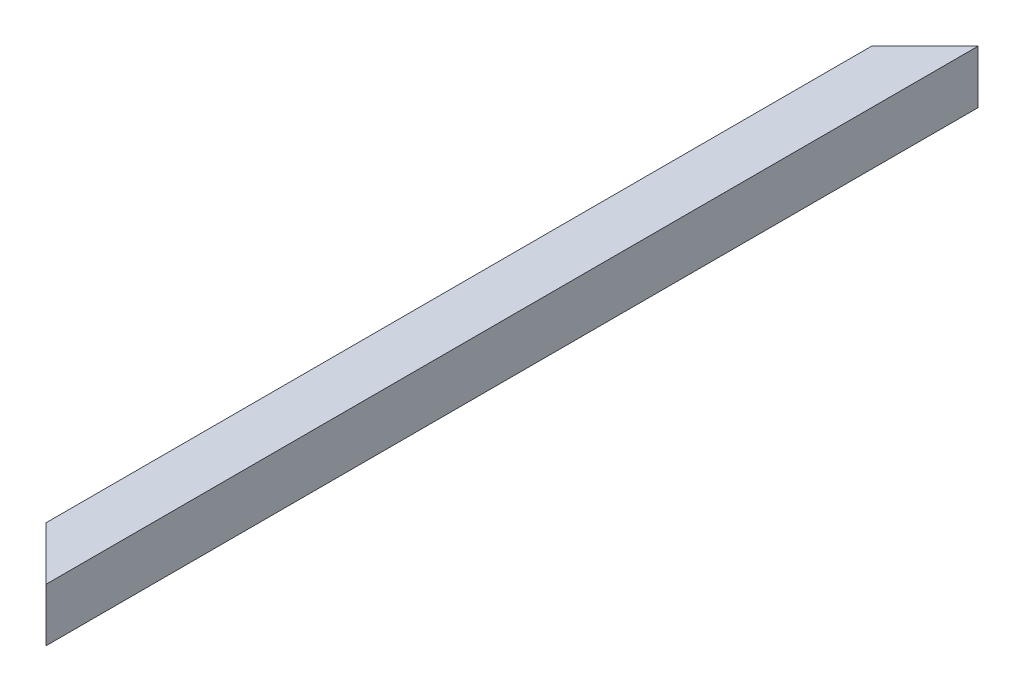
ISO-10303-21;
HEADER;
FILE_DESCRIPTION(('STEP AP214'),'2;1');
FILE_NAME('part.step','',(''),(''),'','','');
FILE_SCHEMA(('AUTOMOTIVE_DESIGN { 1 0 10303 214 1 1 1 1 }'));
ENDSEC;
DATA;
#1=APPLICATION_CONTEXT('core data for automotive mechanical design processes');
#2=APPLICATION_PROTOCOL_DEFINITION('international standard','automotive_design',2000,#1);
#3=PRODUCT_CONTEXT('',#1,'mechanical');
#4=PRODUCT('Part','Part','',(#3));
#5=PRODUCT_RELATED_PRODUCT_CATEGORY('part','',(#4));
#6=PRODUCT_DEFINITION_FORMATION('','',#4);
#7=PRODUCT_DEFINITION_CONTEXT('part definition',#1,'design');
#8=PRODUCT_DEFINITION('design','',#6,#7);
#9=PRODUCT_DEFINITION_SHAPE('','',#8);
#10=(LENGTH_UNIT() NAMED_UNIT(*) SI_UNIT(.MILLI.,.METRE.));
#11=(NAMED_UNIT(*) PLANE_ANGLE_UNIT() SI_UNIT($,.RADIAN.));
#12=(NAMED_UNIT(*) SI_UNIT($,.STERADIAN.) SOLID_ANGLE_UNIT());
#13=UNCERTAINTY_MEASURE_WITH_UNIT(LENGTH_MEASURE(1.E-05),#10,'distance_accuracy_value','');
#14=(GEOMETRIC_REPRESENTATION_CONTEXT(3) GLOBAL_UNCERTAINTY_ASSIGNED_CONTEXT((#13)) GLOBAL_UNIT_ASSIGNED_CONTEXT((#10,
#11,#12)) REPRESENTATION_CONTEXT('',''));
#15=CARTESIAN_POINT('',(0.,0.,0.));
#16=DIRECTION('',(0.,0.,1.));
#17=DIRECTION('',(1.,0.,0.));
#18=AXIS2_PLACEMENT_3D('',#15,#16,#17);
#19=CARTESIAN_POINT('',(-16.,16.,0.));
#20=DIRECTION('',(1.,0.,0.));
#21=DIRECTION('',(0.,0.,-1.));
#22=AXIS2_PLACEMENT_3D('',#19,#20,#21);
#23=PLANE('',#22);
#24=DIRECTION('',(0.,-1.,0.));
#25=VECTOR('',#24,1.);
#26=CARTESIAN_POINT('',(-16.,16.,35.9999999999996));
#27=LINE('',#26,#25);
#28=CARTESIAN_POINT('',(-16.,16.,35.9999999999996));
#29=VERTEX_POINT('',#28);
#30=CARTESIAN_POINT('',(-16.,-16.,35.9999999999996));
#31=VERTEX_POINT('',#30);
#32=EDGE_CURVE('E11',#29,#31,#27,.T.);
#33=ORIENTED_EDGE('',*,*,#32,.F.);
#34=DIRECTION('',(0.,0.,1.));
#35=VECTOR('',#34,1.);
#36=CARTESIAN_POINT('',(-16.,16.,0.));
#37=LINE('',#36,#35);
#38=CARTESIAN_POINT('',(-16.,16.,664.));
#39=VERTEX_POINT('',#38);
#40=EDGE_CURVE('E148',#29,#39,#37,.T.);
#41=ORIENTED_EDGE('',*,*,#40,.T.);
#42=DIRECTION('',(0.,1.,0.));
#43=VECTOR('',#42,1.);
#44=CARTESIAN_POINT('',(-16.,16.,664.));
#45=LINE('',#44,#43);
#46=CARTESIAN_POINT('',(-16.,-16.,664.));
#47=VERTEX_POINT('',#46);
#48=EDGE_CURVE('E46',#47,#39,#45,.T.);
#49=ORIENTED_EDGE('',*,*,#48,.F.);
#50=DIRECTION('',(0.,0.,1.));
#51=VECTOR('',#50,1.);
#52=CARTESIAN_POINT('',(-16.,-16.,0.));
#53=LINE('',#52,#51);
#54=EDGE_CURVE('E135',#31,#47,#53,.T.);
#55=ORIENTED_EDGE('',*,*,#54,.F.);
#56=EDGE_LOOP('',(#33,#41,#49,#55));
#57=FACE_BOUND('',#56,.T.);
#58=ADVANCED_FACE('F38',(#57),#23,.T.);
#59=CARTESIAN_POINT('',(-16.,-16.,0.));
#60=DIRECTION('',(0.,1.,0.));
#61=DIRECTION('',(0.,0.,1.));
#62=AXIS2_PLACEMENT_3D('',#59,#60,#61);
#63=PLANE('',#62);
#64=DIRECTION('',(0.707106781186551,0.,-0.707106781186544));
#65=VECTOR('',#64,1.);
#66=CARTESIAN_POINT('',(1.99999999999982,-16.,18.));
#67=LINE('',#66,#65);
#68=CARTESIAN_POINT('',(16.,-16.,3.99999999999997));
#69=VERTEX_POINT('',#68);
#70=EDGE_CURVE('E168',#31,#69,#67,.T.);
#71=ORIENTED_EDGE('',*,*,#70,.F.);
#72=ORIENTED_EDGE('',*,*,#54,.T.);
#73=DIRECTION('',(-0.707106781186551,0.,-0.707106781186544));
#74=VECTOR('',#73,1.);
#75=CARTESIAN_POINT('',(-348.,-16.,332.000000000004));
#76=LINE('',#75,#74);
#77=CARTESIAN_POINT('',(16.,-16.,696.));
#78=VERTEX_POINT('',#77);
#79=EDGE_CURVE('E60',#78,#47,#76,.T.);
#80=ORIENTED_EDGE('',*,*,#79,.F.);
#81=DIRECTION('',(0.,0.,1.));
#82=VECTOR('',#81,1.);
#83=CARTESIAN_POINT('',(16.,-16.,0.));
#84=LINE('',#83,#82);
#85=EDGE_CURVE('E138',#69,#78,#84,.T.);
#86=ORIENTED_EDGE('',*,*,#85,.F.);
#87=EDGE_LOOP('',(#71,#72,#80,#86));
#88=FACE_BOUND('',#87,.T.);
#89=ADVANCED_FACE('F184',(#88),#63,.T.);
#90=CARTESIAN_POINT('',(16.,16.,0.));
#91=DIRECTION('',(-1.,0.,0.));
#92=DIRECTION('',(0.,0.,1.));
#93=AXIS2_PLACEMENT_3D('',#90,#91,#92);
#94=PLANE('',#93);
#95=DIRECTION('',(0.,1.,0.));
#96=VECTOR('',#95,1.);
#97=CARTESIAN_POINT('',(16.,16.,3.99999999999997));
#98=LINE('',#97,#96);
#99=CARTESIAN_POINT('',(16.,16.,3.99999999999997));
#100=VERTEX_POINT('',#99);
#101=EDGE_CURVE('E170',#69,#100,#98,.T.);
#102=ORIENTED_EDGE('',*,*,#101,.F.);
#103=ORIENTED_EDGE('',*,*,#85,.T.);
#104=DIRECTION('',(0.,-1.,0.));
#105=VECTOR('',#104,1.);
#106=CARTESIAN_POINT('',(16.,16.,696.));
#107=LINE('',#106,#105);
#108=CARTESIAN_POINT('',(16.,16.,696.));
#109=VERTEX_POINT('',#108);
#110=EDGE_CURVE('E164',#109,#78,#107,.T.);
#111=ORIENTED_EDGE('',*,*,#110,.F.);
#112=DIRECTION('',(0.,0.,1.));
#113=VECTOR('',#112,1.);
#114=CARTESIAN_POINT('',(16.,16.,0.));
#115=LINE('',#114,#113);
#116=EDGE_CURVE('E144',#100,#109,#115,.T.);
#117=ORIENTED_EDGE('',*,*,#116,.F.);
#118=EDGE_LOOP('',(#102,#103,#111,#117));
#119=FACE_BOUND('',#118,.T.);
#120=ADVANCED_FACE('F181',(#119),#94,.T.);
#121=CARTESIAN_POINT('',(-16.,16.,0.));
#122=DIRECTION('',(0.,-1.,0.));
#123=DIRECTION('',(0.,0.,-1.));
#124=AXIS2_PLACEMENT_3D('',#121,#122,#123);
#125=PLANE('',#124);
#126=DIRECTION('',(-0.707106781186551,0.,0.707106781186544));
#127=VECTOR('',#126,1.);
#128=CARTESIAN_POINT('',(1.99999999999982,16.,18.));
#129=LINE('',#128,#127);
#130=EDGE_CURVE('E52',#100,#29,#129,.T.);
#131=ORIENTED_EDGE('',*,*,#130,.F.);
#132=ORIENTED_EDGE('',*,*,#116,.T.);
#133=DIRECTION('',(0.707106781186551,0.,0.707106781186544));
#134=VECTOR('',#133,1.);
#135=CARTESIAN_POINT('',(-348.,16.,332.000000000004));
#136=LINE('',#135,#134);
#137=EDGE_CURVE('E166',#39,#109,#136,.T.);
#138=ORIENTED_EDGE('',*,*,#137,.F.);
#139=ORIENTED_EDGE('',*,*,#40,.F.);
#140=EDGE_LOOP('',(#131,#132,#138,#139));
#141=FACE_BOUND('',#140,.T.);
#142=ADVANCED_FACE('F176',(#141),#125,.T.);
#143=CARTESIAN_POINT('',(20.,-20.,700.));
#144=DIRECTION('',(0.707106781186544,0.,-0.707106781186551));
#145=DIRECTION('',(-0.707106781186551,0.,-0.707106781186544));
#146=AXIS2_PLACEMENT_3D('',#143,#144,#145);
#147=PLANE('',#146);
#148=ORIENTED_EDGE('',*,*,#137,.T.);
#149=ORIENTED_EDGE('',*,*,#110,.T.);
#150=ORIENTED_EDGE('',*,*,#79,.T.);
#151=ORIENTED_EDGE('',*,*,#48,.T.);
#152=EDGE_LOOP('',(#148,#149,#150,#151));
#153=FACE_BOUND('',#152,.T.);
#154=DIRECTION('',(-0.707106781186551,0.,-0.707106781186544));
#155=VECTOR('',#154,1.);
#156=CARTESIAN_POINT('',(20.,20.,700.));
#157=LINE('',#156,#155);
#158=CARTESIAN_POINT('',(20.,20.,700.));
#159=VERTEX_POINT('',#158);
#160=CARTESIAN_POINT('',(-20.,20.,660.));
#161=VERTEX_POINT('',#160);
#162=EDGE_CURVE('E157',#159,#161,#157,.T.);
#163=ORIENTED_EDGE('',*,*,#162,.T.);
#164=DIRECTION('',(0.,1.,0.));
#165=VECTOR('',#164,1.);
#166=CARTESIAN_POINT('',(-20.,-20.,660.));
#167=LINE('',#166,#165);
#168=CARTESIAN_POINT('',(-20.,-20.,660.));
#169=VERTEX_POINT('',#168);
#170=EDGE_CURVE('E159',#169,#161,#167,.T.);
#171=ORIENTED_EDGE('',*,*,#170,.F.);
#172=DIRECTION('',(-0.707106781186551,0.,-0.707106781186544));
#173=VECTOR('',#172,1.);
#174=CARTESIAN_POINT('',(20.,-20.,700.));
#175=LINE('',#174,#173);
#176=CARTESIAN_POINT('',(20.,-20.,700.));
#177=VERTEX_POINT('',#176);
#178=EDGE_CURVE('E125',#177,#169,#175,.T.);
#179=ORIENTED_EDGE('',*,*,#178,.F.);
#180=DIRECTION('',(0.,1.,0.));
#181=VECTOR('',#180,1.);
#182=CARTESIAN_POINT('',(20.,20.,700.));
#183=LINE('',#182,#181);
#184=EDGE_CURVE('E147',#177,#159,#183,.T.);
#185=ORIENTED_EDGE('',*,*,#184,.T.);
#186=EDGE_LOOP('',(#163,#171,#179,#185));
#187=FACE_BOUND('',#186,.T.);
#188=ADVANCED_FACE('F183',(#153,#187),#147,.F.);
#189=CARTESIAN_POINT('',(20.,-20.,0.));
#190=DIRECTION('',(0.707106781186544,0.,0.707106781186551));
#191=DIRECTION('',(0.707106781186551,0.,-0.707106781186544));
#192=AXIS2_PLACEMENT_3D('',#189,#190,#191);
#193=PLANE('',#192);
#194=ORIENTED_EDGE('',*,*,#130,.T.);
#195=ORIENTED_EDGE('',*,*,#32,.T.);
#196=ORIENTED_EDGE('',*,*,#70,.T.);
#197=ORIENTED_EDGE('',*,*,#101,.T.);
#198=EDGE_LOOP('',(#194,#195,#196,#197));
#199=FACE_BOUND('',#198,.T.);
#200=DIRECTION('',(0.707106781186551,0.,-0.707106781186544));
#201=VECTOR('',#200,1.);
#202=CARTESIAN_POINT('',(20.,20.,0.));
#203=LINE('',#202,#201);
#204=CARTESIAN_POINT('',(-20.,20.,39.9999999999996));
#205=VERTEX_POINT('',#204);
#206=CARTESIAN_POINT('',(20.,20.,0.));
#207=VERTEX_POINT('',#206);
#208=EDGE_CURVE('E112',#205,#207,#203,.T.);
#209=ORIENTED_EDGE('',*,*,#208,.T.);
#210=DIRECTION('',(0.,1.,0.));
#211=VECTOR('',#210,1.);
#212=CARTESIAN_POINT('',(20.,20.,0.));
#213=LINE('',#212,#211);
#214=CARTESIAN_POINT('',(20.,-20.,0.));
#215=VERTEX_POINT('',#214);
#216=EDGE_CURVE('E107',#215,#207,#213,.T.);
#217=ORIENTED_EDGE('',*,*,#216,.F.);
#218=DIRECTION('',(0.707106781186551,0.,-0.707106781186544));
#219=VECTOR('',#218,1.);
#220=CARTESIAN_POINT('',(20.,-20.,0.));
#221=LINE('',#220,#219);
#222=CARTESIAN_POINT('',(-20.,-20.,39.9999999999996));
#223=VERTEX_POINT('',#222);
#224=EDGE_CURVE('E101',#223,#215,#221,.T.);
#225=ORIENTED_EDGE('',*,*,#224,.F.);
#226=DIRECTION('',(0.,1.,0.));
#227=VECTOR('',#226,1.);
#228=CARTESIAN_POINT('',(-20.,-20.,39.9999999999996));
#229=LINE('',#228,#227);
#230=EDGE_CURVE('E104',#223,#205,#229,.T.);
#231=ORIENTED_EDGE('',*,*,#230,.T.);
#232=EDGE_LOOP('',(#209,#217,#225,#231));
#233=FACE_BOUND('',#232,.T.);
#234=ADVANCED_FACE('F103',(#199,#233),#193,.F.);
#235=CARTESIAN_POINT('',(-20.,20.,0.));
#236=DIRECTION('',(-1.,0.,0.));
#237=DIRECTION('',(0.,0.,1.));
#238=AXIS2_PLACEMENT_3D('',#235,#236,#237);
#239=PLANE('',#238);
#240=ORIENTED_EDGE('',*,*,#230,.F.);
#241=DIRECTION('',(0.,0.,1.));
#242=VECTOR('',#241,1.);
#243=CARTESIAN_POINT('',(-20.,-20.,0.));
#244=LINE('',#243,#242);
#245=EDGE_CURVE('E119',#223,#169,#244,.T.);
#246=ORIENTED_EDGE('',*,*,#245,.T.);
#247=ORIENTED_EDGE('',*,*,#170,.T.);
#248=DIRECTION('',(0.,0.,1.));
#249=VECTOR('',#248,1.);
#250=CARTESIAN_POINT('',(-20.,20.,0.));
#251=LINE('',#250,#249);
#252=EDGE_CURVE('E121',#205,#161,#251,.T.);
#253=ORIENTED_EDGE('',*,*,#252,.F.);
#254=EDGE_LOOP('',(#240,#246,#247,#253));
#255=FACE_BOUND('',#254,.T.);
#256=ADVANCED_FACE('F117',(#255),#239,.T.);
#257=CARTESIAN_POINT('',(-20.,-20.,0.));
#258=DIRECTION('',(0.,-1.,0.));
#259=DIRECTION('',(0.,0.,-1.));
#260=AXIS2_PLACEMENT_3D('',#257,#258,#259);
#261=PLANE('',#260);
#262=ORIENTED_EDGE('',*,*,#224,.T.);
#263=DIRECTION('',(0.,0.,1.));
#264=VECTOR('',#263,1.);
#265=CARTESIAN_POINT('',(20.,-20.,0.));
#266=LINE('',#265,#264);
#267=EDGE_CURVE('E126',#215,#177,#266,.T.);
#268=ORIENTED_EDGE('',*,*,#267,.T.);
#269=ORIENTED_EDGE('',*,*,#178,.T.);
#270=ORIENTED_EDGE('',*,*,#245,.F.);
#271=EDGE_LOOP('',(#262,#268,#269,#270));
#272=FACE_BOUND('',#271,.T.);
#273=ADVANCED_FACE('F124',(#272),#261,.T.);
#274=CARTESIAN_POINT('',(20.,20.,0.));
#275=DIRECTION('',(1.,0.,0.));
#276=DIRECTION('',(0.,0.,-1.));
#277=AXIS2_PLACEMENT_3D('',#274,#275,#276);
#278=PLANE('',#277);
#279=DIRECTION('',(0.,0.,1.));
#280=VECTOR('',#279,1.);
#281=CARTESIAN_POINT('',(20.,20.,0.));
#282=LINE('',#281,#280);
#283=EDGE_CURVE('E128',#207,#159,#282,.T.);
#284=ORIENTED_EDGE('',*,*,#283,.T.);
#285=ORIENTED_EDGE('',*,*,#184,.F.);
#286=ORIENTED_EDGE('',*,*,#267,.F.);
#287=ORIENTED_EDGE('',*,*,#216,.T.);
#288=EDGE_LOOP('',(#284,#285,#286,#287));
#289=FACE_BOUND('',#288,.T.);
#290=ADVANCED_FACE('F155',(#289),#278,.T.);
#291=CARTESIAN_POINT('',(-20.,20.,0.));
#292=DIRECTION('',(0.,1.,0.));
#293=DIRECTION('',(0.,0.,1.));
#294=AXIS2_PLACEMENT_3D('',#291,#292,#293);
#295=PLANE('',#294);
#296=ORIENTED_EDGE('',*,*,#208,.F.);
#297=ORIENTED_EDGE('',*,*,#252,.T.);
#298=ORIENTED_EDGE('',*,*,#162,.F.);
#299=ORIENTED_EDGE('',*,*,#283,.F.);
#300=EDGE_LOOP('',(#296,#297,#298,#299));
#301=FACE_BOUND('',#300,.T.);
#302=ADVANCED_FACE('F40',(#301),#295,.T.);
#303=CLOSED_SHELL('',(#58,#89,#120,#142,#188,#234,#256,#273,#290,#302));
#304=MANIFOLD_SOLID_BREP('B2',#303);
#305=ADVANCED_BREP_SHAPE_REPRESENTATION('',(#18,#304),#14);
#306=SHAPE_DEFINITION_REPRESENTATION(#9,#305);
ENDSEC;
END-ISO-10303-21;
